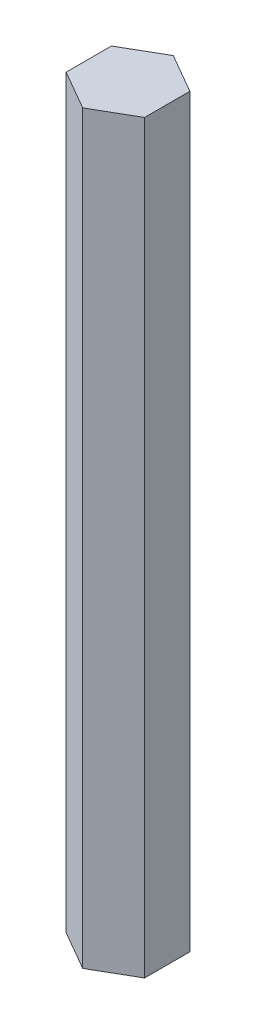
ISO-10303-21;
HEADER;
FILE_DESCRIPTION(('STEP AP214'),'2;1');
FILE_NAME('part.step','',(''),(''),'','','');
FILE_SCHEMA(('AUTOMOTIVE_DESIGN { 1 0 10303 214 1 1 1 1 }'));
ENDSEC;
DATA;
#1=APPLICATION_CONTEXT('core data for automotive mechanical design processes');
#2=APPLICATION_PROTOCOL_DEFINITION('international standard','automotive_design',2000,#1);
#3=PRODUCT_CONTEXT('',#1,'mechanical');
#4=PRODUCT('Part','Part','',(#3));
#5=PRODUCT_RELATED_PRODUCT_CATEGORY('part','',(#4));
#6=PRODUCT_DEFINITION_FORMATION('','',#4);
#7=PRODUCT_DEFINITION_CONTEXT('part definition',#1,'design');
#8=PRODUCT_DEFINITION('design','',#6,#7);
#9=PRODUCT_DEFINITION_SHAPE('','',#8);
#10=(LENGTH_UNIT() NAMED_UNIT(*) SI_UNIT(.MILLI.,.METRE.));
#11=(NAMED_UNIT(*) PLANE_ANGLE_UNIT() SI_UNIT($,.RADIAN.));
#12=(NAMED_UNIT(*) SI_UNIT($,.STERADIAN.) SOLID_ANGLE_UNIT());
#13=UNCERTAINTY_MEASURE_WITH_UNIT(LENGTH_MEASURE(1.E-05),#10,'distance_accuracy_value','');
#14=(GEOMETRIC_REPRESENTATION_CONTEXT(3) GLOBAL_UNCERTAINTY_ASSIGNED_CONTEXT((#13)) GLOBAL_UNIT_ASSIGNED_CONTEXT((#10,
#11,#12)) REPRESENTATION_CONTEXT('',''));
#15=CARTESIAN_POINT('',(0.,0.,0.));
#16=DIRECTION('',(0.,0.,1.));
#17=DIRECTION('',(1.,0.,0.));
#18=AXIS2_PLACEMENT_3D('',#15,#16,#17);
#19=CARTESIAN_POINT('',(6.34999999999995,120.65,-3.66617420935419));
#20=DIRECTION('',(-0.499999999999995,0.,0.866025403784441));
#21=DIRECTION('',(0.866025403784442,0.,0.499999999999995));
#22=AXIS2_PLACEMENT_3D('',#19,#20,#21);
#23=PLANE('',#22);
#24=DIRECTION('',(-0.866025403784441,0.,-0.499999999999995));
#25=VECTOR('',#24,1.);
#26=CARTESIAN_POINT('',(6.34999999999995,0.,-3.66617420935419));
#27=LINE('',#26,#25);
#28=CARTESIAN_POINT('',(6.34999999999995,0.,-3.66617420935419));
#29=VERTEX_POINT('',#28);
#30=CARTESIAN_POINT('',(0.,0.,-7.33234841870824));
#31=VERTEX_POINT('',#30);
#32=EDGE_CURVE('E118',#29,#31,#27,.T.);
#33=ORIENTED_EDGE('',*,*,#32,.T.);
#34=DIRECTION('',(0.,-1.,0.));
#35=VECTOR('',#34,1.);
#36=CARTESIAN_POINT('',(0.,120.65,-7.33234841870824));
#37=LINE('',#36,#35);
#38=CARTESIAN_POINT('',(0.,120.65,-7.33234841870824));
#39=VERTEX_POINT('',#38);
#40=EDGE_CURVE('E11',#39,#31,#37,.T.);
#41=ORIENTED_EDGE('',*,*,#40,.F.);
#42=DIRECTION('',(-0.866025403784441,0.,-0.499999999999995));
#43=VECTOR('',#42,1.);
#44=CARTESIAN_POINT('',(6.34999999999995,120.65,-3.66617420935419));
#45=LINE('',#44,#43);
#46=CARTESIAN_POINT('',(6.34999999999995,120.65,-3.66617420935419));
#47=VERTEX_POINT('',#46);
#48=EDGE_CURVE('E129',#47,#39,#45,.T.);
#49=ORIENTED_EDGE('',*,*,#48,.F.);
#50=DIRECTION('',(0.,-1.,0.));
#51=VECTOR('',#50,1.);
#52=CARTESIAN_POINT('',(6.34999999999995,120.65,-3.66617420935419));
#53=LINE('',#52,#51);
#54=EDGE_CURVE('E114',#47,#29,#53,.T.);
#55=ORIENTED_EDGE('',*,*,#54,.T.);
#56=EDGE_LOOP('',(#33,#41,#49,#55));
#57=FACE_BOUND('',#56,.T.);
#58=ADVANCED_FACE('F32',(#57),#23,.F.);
#59=CARTESIAN_POINT('',(0.,120.65,-7.33234841870824));
#60=DIRECTION('',(0.500000000000001,0.,0.866025403784438));
#61=DIRECTION('',(0.866025403784438,0.,-0.500000000000001));
#62=AXIS2_PLACEMENT_3D('',#59,#60,#61);
#63=PLANE('',#62);
#64=DIRECTION('',(-0.866025403784438,0.,0.500000000000001));
#65=VECTOR('',#64,1.);
#66=CARTESIAN_POINT('',(0.,0.,-7.33234841870824));
#67=LINE('',#66,#65);
#68=CARTESIAN_POINT('',(-6.35,0.,-3.6661742093541));
#69=VERTEX_POINT('',#68);
#70=EDGE_CURVE('E121',#31,#69,#67,.T.);
#71=ORIENTED_EDGE('',*,*,#70,.T.);
#72=DIRECTION('',(0.,-1.,0.));
#73=VECTOR('',#72,1.);
#74=CARTESIAN_POINT('',(-6.35,120.65,-3.6661742093541));
#75=LINE('',#74,#73);
#76=CARTESIAN_POINT('',(-6.35,120.65,-3.6661742093541));
#77=VERTEX_POINT('',#76);
#78=EDGE_CURVE('E40',#77,#69,#75,.T.);
#79=ORIENTED_EDGE('',*,*,#78,.F.);
#80=DIRECTION('',(-0.866025403784438,0.,0.500000000000001));
#81=VECTOR('',#80,1.);
#82=CARTESIAN_POINT('',(0.,120.65,-7.33234841870824));
#83=LINE('',#82,#81);
#84=EDGE_CURVE('E86',#39,#77,#83,.T.);
#85=ORIENTED_EDGE('',*,*,#84,.F.);
#86=ORIENTED_EDGE('',*,*,#40,.T.);
#87=EDGE_LOOP('',(#71,#79,#85,#86));
#88=FACE_BOUND('',#87,.T.);
#89=ADVANCED_FACE('F153',(#88),#63,.F.);
#90=CARTESIAN_POINT('',(-6.35,120.65,-3.6661742093541));
#91=DIRECTION('',(1.,0.,0.));
#92=DIRECTION('',(0.,0.,-1.));
#93=AXIS2_PLACEMENT_3D('',#90,#91,#92);
#94=PLANE('',#93);
#95=DIRECTION('',(0.,0.,1.));
#96=VECTOR('',#95,1.);
#97=CARTESIAN_POINT('',(-6.35,0.,-3.6661742093541));
#98=LINE('',#97,#96);
#99=CARTESIAN_POINT('',(-6.34999999999997,0.,3.66617420935415));
#100=VERTEX_POINT('',#99);
#101=EDGE_CURVE('E124',#69,#100,#98,.T.);
#102=ORIENTED_EDGE('',*,*,#101,.T.);
#103=DIRECTION('',(0.,-1.,0.));
#104=VECTOR('',#103,1.);
#105=CARTESIAN_POINT('',(-6.34999999999997,120.65,3.66617420935415));
#106=LINE('',#105,#104);
#107=CARTESIAN_POINT('',(-6.34999999999997,120.65,3.66617420935415));
#108=VERTEX_POINT('',#107);
#109=EDGE_CURVE('E109',#108,#100,#106,.T.);
#110=ORIENTED_EDGE('',*,*,#109,.F.);
#111=DIRECTION('',(0.,0.,1.));
#112=VECTOR('',#111,1.);
#113=CARTESIAN_POINT('',(-6.35,120.65,-3.6661742093541));
#114=LINE('',#113,#112);
#115=EDGE_CURVE('E100',#77,#108,#114,.T.);
#116=ORIENTED_EDGE('',*,*,#115,.F.);
#117=ORIENTED_EDGE('',*,*,#78,.T.);
#118=EDGE_LOOP('',(#102,#110,#116,#117));
#119=FACE_BOUND('',#118,.T.);
#120=ADVANCED_FACE('F135',(#119),#94,.F.);
#121=CARTESIAN_POINT('',(-6.34999999999997,120.65,3.66617420935415));
#122=DIRECTION('',(0.499999999999995,0.,-0.866025403784441));
#123=DIRECTION('',(-0.866025403784442,0.,-0.499999999999995));
#124=AXIS2_PLACEMENT_3D('',#121,#122,#123);
#125=PLANE('',#124);
#126=DIRECTION('',(0.866025403784441,0.,0.499999999999995));
#127=VECTOR('',#126,1.);
#128=CARTESIAN_POINT('',(-6.34999999999997,0.,3.66617420935415));
#129=LINE('',#128,#127);
#130=CARTESIAN_POINT('',(0.,0.,7.33234841870824));
#131=VERTEX_POINT('',#130);
#132=EDGE_CURVE('E108',#100,#131,#129,.T.);
#133=ORIENTED_EDGE('',*,*,#132,.T.);
#134=DIRECTION('',(0.,-1.,0.));
#135=VECTOR('',#134,1.);
#136=CARTESIAN_POINT('',(0.,120.65,7.33234841870824));
#137=LINE('',#136,#135);
#138=CARTESIAN_POINT('',(0.,120.65,7.33234841870824));
#139=VERTEX_POINT('',#138);
#140=EDGE_CURVE('E105',#139,#131,#137,.T.);
#141=ORIENTED_EDGE('',*,*,#140,.F.);
#142=DIRECTION('',(0.866025403784441,0.,0.499999999999995));
#143=VECTOR('',#142,1.);
#144=CARTESIAN_POINT('',(-6.34999999999997,120.65,3.66617420935415));
#145=LINE('',#144,#143);
#146=EDGE_CURVE('E94',#108,#139,#145,.T.);
#147=ORIENTED_EDGE('',*,*,#146,.F.);
#148=ORIENTED_EDGE('',*,*,#109,.T.);
#149=EDGE_LOOP('',(#133,#141,#147,#148));
#150=FACE_BOUND('',#149,.T.);
#151=ADVANCED_FACE('F106',(#150),#125,.F.);
#152=CARTESIAN_POINT('',(0.,120.65,7.33234841870824));
#153=DIRECTION('',(-0.500000000000007,0.,-0.866025403784434));
#154=DIRECTION('',(-0.866025403784435,0.,0.500000000000007));
#155=AXIS2_PLACEMENT_3D('',#152,#153,#154);
#156=PLANE('',#155);
#157=DIRECTION('',(0.866025403784435,0.,-0.500000000000007));
#158=VECTOR('',#157,1.);
#159=CARTESIAN_POINT('',(0.,0.,7.33234841870824));
#160=LINE('',#159,#158);
#161=CARTESIAN_POINT('',(6.35000000000002,0.,3.66617420935406));
#162=VERTEX_POINT('',#161);
#163=EDGE_CURVE('E72',#131,#162,#160,.T.);
#164=ORIENTED_EDGE('',*,*,#163,.T.);
#165=DIRECTION('',(0.,-1.,0.));
#166=VECTOR('',#165,1.);
#167=CARTESIAN_POINT('',(6.35000000000002,120.65,3.66617420935406));
#168=LINE('',#167,#166);
#169=CARTESIAN_POINT('',(6.35000000000002,120.65,3.66617420935406));
#170=VERTEX_POINT('',#169);
#171=EDGE_CURVE('E110',#170,#162,#168,.T.);
#172=ORIENTED_EDGE('',*,*,#171,.F.);
#173=DIRECTION('',(0.866025403784435,0.,-0.500000000000007));
#174=VECTOR('',#173,1.);
#175=CARTESIAN_POINT('',(0.,120.65,7.33234841870824));
#176=LINE('',#175,#174);
#177=EDGE_CURVE('E98',#139,#170,#176,.T.);
#178=ORIENTED_EDGE('',*,*,#177,.F.);
#179=ORIENTED_EDGE('',*,*,#140,.T.);
#180=EDGE_LOOP('',(#164,#172,#178,#179));
#181=FACE_BOUND('',#180,.T.);
#182=ADVANCED_FACE('F112',(#181),#156,.F.);
#183=CARTESIAN_POINT('',(6.35000000000002,120.65,3.66617420935406));
#184=DIRECTION('',(-1.,0.,0.));
#185=DIRECTION('',(0.,0.,1.));
#186=AXIS2_PLACEMENT_3D('',#183,#184,#185);
#187=PLANE('',#186);
#188=DIRECTION('',(0.,0.,-1.));
#189=VECTOR('',#188,1.);
#190=CARTESIAN_POINT('',(6.35000000000002,0.,3.66617420935406));
#191=LINE('',#190,#189);
#192=EDGE_CURVE('E78',#162,#29,#191,.T.);
#193=ORIENTED_EDGE('',*,*,#192,.T.);
#194=ORIENTED_EDGE('',*,*,#54,.F.);
#195=DIRECTION('',(0.,0.,-1.));
#196=VECTOR('',#195,1.);
#197=CARTESIAN_POINT('',(6.35000000000002,120.65,3.66617420935406));
#198=LINE('',#197,#196);
#199=EDGE_CURVE('E48',#170,#47,#198,.T.);
#200=ORIENTED_EDGE('',*,*,#199,.F.);
#201=ORIENTED_EDGE('',*,*,#171,.T.);
#202=EDGE_LOOP('',(#193,#194,#200,#201));
#203=FACE_BOUND('',#202,.T.);
#204=ADVANCED_FACE('F142',(#203),#187,.F.);
#205=CARTESIAN_POINT('',(0.,120.65,0.));
#206=DIRECTION('',(0.,1.,0.));
#207=DIRECTION('',(0.,0.,1.));
#208=AXIS2_PLACEMENT_3D('',#205,#206,#207);
#209=PLANE('',#208);
#210=ORIENTED_EDGE('',*,*,#48,.T.);
#211=ORIENTED_EDGE('',*,*,#84,.T.);
#212=ORIENTED_EDGE('',*,*,#115,.T.);
#213=ORIENTED_EDGE('',*,*,#146,.T.);
#214=ORIENTED_EDGE('',*,*,#177,.T.);
#215=ORIENTED_EDGE('',*,*,#199,.T.);
#216=EDGE_LOOP('',(#210,#211,#212,#213,#214,#215));
#217=FACE_BOUND('',#216,.T.);
#218=ADVANCED_FACE('F96',(#217),#209,.T.);
#219=CARTESIAN_POINT('',(0.,0.,0.));
#220=DIRECTION('',(0.,1.,0.));
#221=DIRECTION('',(0.,0.,1.));
#222=AXIS2_PLACEMENT_3D('',#219,#220,#221);
#223=PLANE('',#222);
#224=CARTESIAN_POINT('',(0.,0.,0.));
#225=DIRECTION('',(0.,-1.,0.));
#226=DIRECTION('',(0.,0.,-1.));
#227=AXIS2_PLACEMENT_3D('',#224,#225,#226);
#228=CIRCLE('',#227,2.413);
#229=CARTESIAN_POINT('',(0.,0.,-2.413));
#230=VERTEX_POINT('',#229);
#231=EDGE_CURVE('E239',#230,#230,#228,.T.);
#232=ORIENTED_EDGE('',*,*,#231,.F.);
#233=EDGE_LOOP('',(#232));
#234=FACE_BOUND('',#233,.T.);
#235=ORIENTED_EDGE('',*,*,#32,.F.);
#236=ORIENTED_EDGE('',*,*,#192,.F.);
#237=ORIENTED_EDGE('',*,*,#163,.F.);
#238=ORIENTED_EDGE('',*,*,#132,.F.);
#239=ORIENTED_EDGE('',*,*,#101,.F.);
#240=ORIENTED_EDGE('',*,*,#70,.F.);
#241=EDGE_LOOP('',(#235,#236,#237,#238,#239,#240));
#242=FACE_BOUND('',#241,.T.);
#243=ADVANCED_FACE('F138',(#234,#242),#223,.F.);
#244=CARTESIAN_POINT('',(0.,16.764,0.));
#245=DIRECTION('',(0.,-1.,0.));
#246=DIRECTION('',(0.,0.,-1.));
#247=AXIS2_PLACEMENT_3D('',#244,#245,#246);
#248=CONICAL_SURFACE('',#247,2.0193,1.02974425867665);
#249=CARTESIAN_POINT('',(0.,17.9773178480024,0.));
#250=VERTEX_POINT('',#249);
#251=VERTEX_LOOP('',#250);
#252=FACE_BOUND('',#251,.T.);
#253=CARTESIAN_POINT('',(0.,16.764,0.));
#254=DIRECTION('',(0.,-1.,0.));
#255=DIRECTION('',(0.,0.,-1.));
#256=AXIS2_PLACEMENT_3D('',#253,#254,#255);
#257=CIRCLE('',#256,2.0193);
#258=CARTESIAN_POINT('',(0.,16.764,-2.0193));
#259=VERTEX_POINT('',#258);
#260=EDGE_CURVE('E122',#259,#259,#257,.T.);
#261=ORIENTED_EDGE('',*,*,#260,.T.);
#262=EDGE_LOOP('',(#261));
#263=FACE_BOUND('',#262,.T.);
#264=ADVANCED_FACE('F190',(#252,#263),#248,.F.);
#265=CARTESIAN_POINT('',(0.,0.,0.));
#266=DIRECTION('',(0.,-1.,0.));
#267=DIRECTION('',(0.,0.,-1.));
#268=AXIS2_PLACEMENT_3D('',#265,#266,#267);
#269=CYLINDRICAL_SURFACE('',#268,2.0193);
#270=ORIENTED_EDGE('',*,*,#260,.F.);
#271=EDGE_LOOP('',(#270));
#272=FACE_BOUND('',#271,.T.);
#273=CARTESIAN_POINT('',(0.,12.7,0.));
#274=DIRECTION('',(0.,-1.,0.));
#275=DIRECTION('',(0.,0.,-1.));
#276=AXIS2_PLACEMENT_3D('',#273,#274,#275);
#277=CIRCLE('',#276,2.0193);
#278=CARTESIAN_POINT('',(0.,12.7,-2.0193));
#279=VERTEX_POINT('',#278);
#280=EDGE_CURVE('E241',#279,#279,#277,.T.);
#281=ORIENTED_EDGE('',*,*,#280,.T.);
#282=EDGE_LOOP('',(#281));
#283=FACE_BOUND('',#282,.T.);
#284=ADVANCED_FACE('F199',(#272,#283),#269,.F.);
#285=CARTESIAN_POINT('',(2.0193,12.7,0.));
#286=DIRECTION('',(0.,1.,0.));
#287=DIRECTION('',(0.,0.,1.));
#288=AXIS2_PLACEMENT_3D('',#285,#286,#287);
#289=PLANE('',#288);
#290=ORIENTED_EDGE('',*,*,#280,.F.);
#291=EDGE_LOOP('',(#290));
#292=FACE_BOUND('',#291,.T.);
#293=CARTESIAN_POINT('',(0.,12.7,0.));
#294=DIRECTION('',(0.,-1.,0.));
#295=DIRECTION('',(0.,0.,-1.));
#296=AXIS2_PLACEMENT_3D('',#293,#294,#295);
#297=CIRCLE('',#296,2.413);
#298=CARTESIAN_POINT('',(0.,12.7,-2.413));
#299=VERTEX_POINT('',#298);
#300=EDGE_CURVE('E236',#299,#299,#297,.T.);
#301=ORIENTED_EDGE('',*,*,#300,.T.);
#302=EDGE_LOOP('',(#301));
#303=FACE_BOUND('',#302,.T.);
#304=ADVANCED_FACE('F209',(#292,#303),#289,.F.);
#305=CARTESIAN_POINT('',(0.,0.,0.));
#306=DIRECTION('',(0.,-1.,0.));
#307=DIRECTION('',(0.,0.,-1.));
#308=AXIS2_PLACEMENT_3D('',#305,#306,#307);
#309=CYLINDRICAL_SURFACE('',#308,2.413);
#310=ORIENTED_EDGE('',*,*,#300,.F.);
#311=EDGE_LOOP('',(#310));
#312=FACE_BOUND('',#311,.T.);
#313=ORIENTED_EDGE('',*,*,#231,.T.);
#314=EDGE_LOOP('',(#313));
#315=FACE_BOUND('',#314,.T.);
#316=ADVANCED_FACE('F219',(#312,#315),#309,.F.);
#317=CLOSED_SHELL('',(#58,#89,#120,#151,#182,#204,#218,#243,#264,#284,#304,#316));
#318=MANIFOLD_SOLID_BREP('B2',#317);
#319=ADVANCED_BREP_SHAPE_REPRESENTATION('',(#18,#318),#14);
#320=SHAPE_DEFINITION_REPRESENTATION(#9,#319);
ENDSEC;
END-ISO-10303-21;
